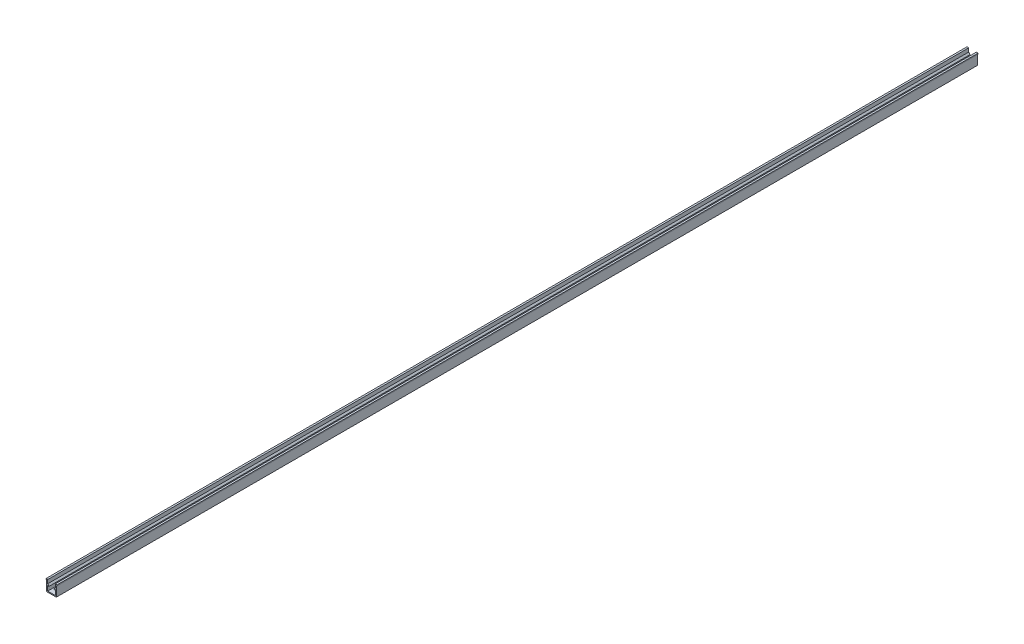
ISO-10303-21;
HEADER;
FILE_DESCRIPTION(('STEP AP214'),'2;1');
FILE_NAME('part.step','',(''),(''),'','','');
FILE_SCHEMA(('AUTOMOTIVE_DESIGN { 1 0 10303 214 1 1 1 1 }'));
ENDSEC;
DATA;
#1=APPLICATION_CONTEXT('core data for automotive mechanical design processes');
#2=APPLICATION_PROTOCOL_DEFINITION('international standard','automotive_design',2000,#1);
#3=PRODUCT_CONTEXT('',#1,'mechanical');
#4=PRODUCT('Part','Part','',(#3));
#5=PRODUCT_RELATED_PRODUCT_CATEGORY('part','',(#4));
#6=PRODUCT_DEFINITION_FORMATION('','',#4);
#7=PRODUCT_DEFINITION_CONTEXT('part definition',#1,'design');
#8=PRODUCT_DEFINITION('design','',#6,#7);
#9=PRODUCT_DEFINITION_SHAPE('','',#8);
#10=(LENGTH_UNIT() NAMED_UNIT(*) SI_UNIT(.MILLI.,.METRE.));
#11=(NAMED_UNIT(*) PLANE_ANGLE_UNIT() SI_UNIT($,.RADIAN.));
#12=(NAMED_UNIT(*) SI_UNIT($,.STERADIAN.) SOLID_ANGLE_UNIT());
#13=UNCERTAINTY_MEASURE_WITH_UNIT(LENGTH_MEASURE(1.E-05),#10,'distance_accuracy_value','');
#14=(GEOMETRIC_REPRESENTATION_CONTEXT(3) GLOBAL_UNCERTAINTY_ASSIGNED_CONTEXT((#13)) GLOBAL_UNIT_ASSIGNED_CONTEXT((#10,
#11,#12)) REPRESENTATION_CONTEXT('',''));
#15=CARTESIAN_POINT('',(0.,0.,0.));
#16=DIRECTION('',(0.,0.,1.));
#17=DIRECTION('',(1.,0.,0.));
#18=AXIS2_PLACEMENT_3D('',#15,#16,#17);
#19=CARTESIAN_POINT('',(-5.2,0.,1000.));
#20=DIRECTION('',(1.,0.,0.));
#21=DIRECTION('',(0.,0.,-1.));
#22=AXIS2_PLACEMENT_3D('',#19,#20,#21);
#23=PLANE('',#22);
#24=DIRECTION('',(0.,-1.,0.));
#25=VECTOR('',#24,1.);
#26=CARTESIAN_POINT('',(-5.2,0.,0.));
#27=LINE('',#26,#25);
#28=CARTESIAN_POINT('',(-5.2,11.,0.));
#29=VERTEX_POINT('',#28);
#30=CARTESIAN_POINT('',(-5.2,0.,0.));
#31=VERTEX_POINT('',#30);
#32=EDGE_CURVE('E203',#29,#31,#27,.T.);
#33=ORIENTED_EDGE('',*,*,#32,.T.);
#34=DIRECTION('',(0.,0.,-1.));
#35=VECTOR('',#34,1.);
#36=CARTESIAN_POINT('',(-5.2,0.,1000.));
#37=LINE('',#36,#35);
#38=CARTESIAN_POINT('',(-5.2,0.,1000.));
#39=VERTEX_POINT('',#38);
#40=EDGE_CURVE('E11',#39,#31,#37,.T.);
#41=ORIENTED_EDGE('',*,*,#40,.F.);
#42=DIRECTION('',(0.,-1.,0.));
#43=VECTOR('',#42,1.);
#44=CARTESIAN_POINT('',(-5.2,0.,1000.));
#45=LINE('',#44,#43);
#46=CARTESIAN_POINT('',(-5.2,11.,1000.));
#47=VERTEX_POINT('',#46);
#48=EDGE_CURVE('E241',#47,#39,#45,.T.);
#49=ORIENTED_EDGE('',*,*,#48,.F.);
#50=DIRECTION('',(0.,0.,-1.));
#51=VECTOR('',#50,1.);
#52=CARTESIAN_POINT('',(-5.2,11.,1000.));
#53=LINE('',#52,#51);
#54=EDGE_CURVE('E199',#47,#29,#53,.T.);
#55=ORIENTED_EDGE('',*,*,#54,.T.);
#56=EDGE_LOOP('',(#33,#41,#49,#55));
#57=FACE_BOUND('',#56,.T.);
#58=ADVANCED_FACE('F35',(#57),#23,.F.);
#59=CARTESIAN_POINT('',(5.2,0.,1000.));
#60=DIRECTION('',(0.,1.,0.));
#61=DIRECTION('',(-1.,0.,0.));
#62=AXIS2_PLACEMENT_3D('',#59,#60,#61);
#63=PLANE('',#62);
#64=DIRECTION('',(1.,0.,0.));
#65=VECTOR('',#64,1.);
#66=CARTESIAN_POINT('',(5.2,0.,0.));
#67=LINE('',#66,#65);
#68=CARTESIAN_POINT('',(5.2,0.,0.));
#69=VERTEX_POINT('',#68);
#70=EDGE_CURVE('E206',#31,#69,#67,.T.);
#71=ORIENTED_EDGE('',*,*,#70,.T.);
#72=DIRECTION('',(0.,0.,-1.));
#73=VECTOR('',#72,1.);
#74=CARTESIAN_POINT('',(5.2,0.,1000.));
#75=LINE('',#74,#73);
#76=CARTESIAN_POINT('',(5.2,0.,1000.));
#77=VERTEX_POINT('',#76);
#78=EDGE_CURVE('E43',#77,#69,#75,.T.);
#79=ORIENTED_EDGE('',*,*,#78,.F.);
#80=DIRECTION('',(1.,0.,0.));
#81=VECTOR('',#80,1.);
#82=CARTESIAN_POINT('',(5.2,0.,1000.));
#83=LINE('',#82,#81);
#84=EDGE_CURVE('E130',#39,#77,#83,.T.);
#85=ORIENTED_EDGE('',*,*,#84,.F.);
#86=ORIENTED_EDGE('',*,*,#40,.T.);
#87=EDGE_LOOP('',(#71,#79,#85,#86));
#88=FACE_BOUND('',#87,.T.);
#89=ADVANCED_FACE('F359',(#88),#63,.F.);
#90=CARTESIAN_POINT('',(5.2,0.,1000.));
#91=DIRECTION('',(-1.,0.,0.));
#92=DIRECTION('',(0.,0.,1.));
#93=AXIS2_PLACEMENT_3D('',#90,#91,#92);
#94=PLANE('',#93);
#95=DIRECTION('',(0.,1.,0.));
#96=VECTOR('',#95,1.);
#97=CARTESIAN_POINT('',(5.2,0.,0.));
#98=LINE('',#97,#96);
#99=CARTESIAN_POINT('',(5.2,11.,0.));
#100=VERTEX_POINT('',#99);
#101=EDGE_CURVE('E208',#69,#100,#98,.T.);
#102=ORIENTED_EDGE('',*,*,#101,.T.);
#103=DIRECTION('',(0.,0.,-1.));
#104=VECTOR('',#103,1.);
#105=CARTESIAN_POINT('',(5.2,11.,1000.));
#106=LINE('',#105,#104);
#107=CARTESIAN_POINT('',(5.2,11.,1000.));
#108=VERTEX_POINT('',#107);
#109=EDGE_CURVE('E284',#108,#100,#106,.T.);
#110=ORIENTED_EDGE('',*,*,#109,.F.);
#111=DIRECTION('',(0.,1.,0.));
#112=VECTOR('',#111,1.);
#113=CARTESIAN_POINT('',(5.2,0.,1000.));
#114=LINE('',#113,#112);
#115=EDGE_CURVE('E292',#77,#108,#114,.T.);
#116=ORIENTED_EDGE('',*,*,#115,.F.);
#117=ORIENTED_EDGE('',*,*,#78,.T.);
#118=EDGE_LOOP('',(#102,#110,#116,#117));
#119=FACE_BOUND('',#118,.T.);
#120=ADVANCED_FACE('F290',(#119),#94,.F.);
#121=CARTESIAN_POINT('',(5.2,11.,1000.));
#122=DIRECTION('',(0.,1.,0.));
#123=DIRECTION('',(-1.,0.,0.));
#124=AXIS2_PLACEMENT_3D('',#121,#122,#123);
#125=PLANE('',#124);
#126=DIRECTION('',(1.,0.,0.));
#127=VECTOR('',#126,1.);
#128=CARTESIAN_POINT('',(5.2,11.,0.));
#129=LINE('',#128,#127);
#130=CARTESIAN_POINT('',(6.,11.,0.));
#131=VERTEX_POINT('',#130);
#132=EDGE_CURVE('E210',#100,#131,#129,.T.);
#133=ORIENTED_EDGE('',*,*,#132,.T.);
#134=DIRECTION('',(0.,0.,-1.));
#135=VECTOR('',#134,1.);
#136=CARTESIAN_POINT('',(6.,11.,1000.));
#137=LINE('',#136,#135);
#138=CARTESIAN_POINT('',(6.,11.,1000.));
#139=VERTEX_POINT('',#138);
#140=EDGE_CURVE('E281',#139,#131,#137,.T.);
#141=ORIENTED_EDGE('',*,*,#140,.F.);
#142=DIRECTION('',(1.,0.,0.));
#143=VECTOR('',#142,1.);
#144=CARTESIAN_POINT('',(5.2,11.,1000.));
#145=LINE('',#144,#143);
#146=EDGE_CURVE('E310',#108,#139,#145,.T.);
#147=ORIENTED_EDGE('',*,*,#146,.F.);
#148=ORIENTED_EDGE('',*,*,#109,.T.);
#149=EDGE_LOOP('',(#133,#141,#147,#148));
#150=FACE_BOUND('',#149,.T.);
#151=ADVANCED_FACE('F301',(#150),#125,.F.);
#152=CARTESIAN_POINT('',(6.,11.,1000.));
#153=DIRECTION('',(-1.,0.,0.));
#154=DIRECTION('',(0.,-1.,0.));
#155=AXIS2_PLACEMENT_3D('',#152,#153,#154);
#156=PLANE('',#155);
#157=DIRECTION('',(0.,1.,0.));
#158=VECTOR('',#157,1.);
#159=CARTESIAN_POINT('',(6.,11.,0.));
#160=LINE('',#159,#158);
#161=CARTESIAN_POINT('',(6.,12.,0.));
#162=VERTEX_POINT('',#161);
#163=EDGE_CURVE('E212',#131,#162,#160,.T.);
#164=ORIENTED_EDGE('',*,*,#163,.T.);
#165=DIRECTION('',(0.,0.,-1.));
#166=VECTOR('',#165,1.);
#167=CARTESIAN_POINT('',(6.,12.,1000.));
#168=LINE('',#167,#166);
#169=CARTESIAN_POINT('',(6.,12.,1000.));
#170=VERTEX_POINT('',#169);
#171=EDGE_CURVE('E278',#170,#162,#168,.T.);
#172=ORIENTED_EDGE('',*,*,#171,.F.);
#173=DIRECTION('',(0.,1.,0.));
#174=VECTOR('',#173,1.);
#175=CARTESIAN_POINT('',(6.,11.,1000.));
#176=LINE('',#175,#174);
#177=EDGE_CURVE('E307',#139,#170,#176,.T.);
#178=ORIENTED_EDGE('',*,*,#177,.F.);
#179=ORIENTED_EDGE('',*,*,#140,.T.);
#180=EDGE_LOOP('',(#164,#172,#178,#179));
#181=FACE_BOUND('',#180,.T.);
#182=ADVANCED_FACE('F305',(#181),#156,.F.);
#183=CARTESIAN_POINT('',(6.,12.,1000.));
#184=DIRECTION('',(0.,-1.,0.));
#185=DIRECTION('',(0.,0.,-1.));
#186=AXIS2_PLACEMENT_3D('',#183,#184,#185);
#187=PLANE('',#186);
#188=DIRECTION('',(-1.,0.,0.));
#189=VECTOR('',#188,1.);
#190=CARTESIAN_POINT('',(6.,12.,0.));
#191=LINE('',#190,#189);
#192=CARTESIAN_POINT('',(4.1,12.,0.));
#193=VERTEX_POINT('',#192);
#194=EDGE_CURVE('E214',#162,#193,#191,.T.);
#195=ORIENTED_EDGE('',*,*,#194,.T.);
#196=DIRECTION('',(0.,0.,-1.));
#197=VECTOR('',#196,1.);
#198=CARTESIAN_POINT('',(4.1,12.,1000.));
#199=LINE('',#198,#197);
#200=CARTESIAN_POINT('',(4.1,12.,1000.));
#201=VERTEX_POINT('',#200);
#202=EDGE_CURVE('E275',#201,#193,#199,.T.);
#203=ORIENTED_EDGE('',*,*,#202,.F.);
#204=DIRECTION('',(-1.,0.,0.));
#205=VECTOR('',#204,1.);
#206=CARTESIAN_POINT('',(6.,12.,1000.));
#207=LINE('',#206,#205);
#208=EDGE_CURVE('E309',#170,#201,#207,.T.);
#209=ORIENTED_EDGE('',*,*,#208,.F.);
#210=ORIENTED_EDGE('',*,*,#171,.T.);
#211=EDGE_LOOP('',(#195,#203,#209,#210));
#212=FACE_BOUND('',#211,.T.);
#213=ADVANCED_FACE('F372',(#212),#187,.F.);
#214=CARTESIAN_POINT('',(4.1,12.,1000.));
#215=DIRECTION('',(1.,0.,0.));
#216=DIRECTION('',(0.,0.,-1.));
#217=AXIS2_PLACEMENT_3D('',#214,#215,#216);
#218=PLANE('',#217);
#219=DIRECTION('',(0.,-1.,0.));
#220=VECTOR('',#219,1.);
#221=CARTESIAN_POINT('',(4.1,12.,0.));
#222=LINE('',#221,#220);
#223=CARTESIAN_POINT('',(4.1,8.,0.));
#224=VERTEX_POINT('',#223);
#225=EDGE_CURVE('E216',#193,#224,#222,.T.);
#226=ORIENTED_EDGE('',*,*,#225,.T.);
#227=DIRECTION('',(0.,0.,-1.));
#228=VECTOR('',#227,1.);
#229=CARTESIAN_POINT('',(4.1,8.,1000.));
#230=LINE('',#229,#228);
#231=CARTESIAN_POINT('',(4.1,8.,1000.));
#232=VERTEX_POINT('',#231);
#233=EDGE_CURVE('E272',#232,#224,#230,.T.);
#234=ORIENTED_EDGE('',*,*,#233,.F.);
#235=DIRECTION('',(0.,-1.,0.));
#236=VECTOR('',#235,1.);
#237=CARTESIAN_POINT('',(4.1,12.,1000.));
#238=LINE('',#237,#236);
#239=EDGE_CURVE('E312',#201,#232,#238,.T.);
#240=ORIENTED_EDGE('',*,*,#239,.F.);
#241=ORIENTED_EDGE('',*,*,#202,.T.);
#242=EDGE_LOOP('',(#226,#234,#240,#241));
#243=FACE_BOUND('',#242,.T.);
#244=ADVANCED_FACE('F375',(#243),#218,.F.);
#245=CARTESIAN_POINT('',(4.1,8.,1000.));
#246=DIRECTION('',(0.707106781186546,-0.707106781186549,0.));
#247=DIRECTION('',(0.707106781186549,0.707106781186546,0.));
#248=AXIS2_PLACEMENT_3D('',#245,#246,#247);
#249=PLANE('',#248);
#250=DIRECTION('',(-0.707106781186549,-0.707106781186546,0.));
#251=VECTOR('',#250,1.);
#252=CARTESIAN_POINT('',(4.1,8.,0.));
#253=LINE('',#252,#251);
#254=CARTESIAN_POINT('',(2.54436508138959,6.4443650813896,0.));
#255=VERTEX_POINT('',#254);
#256=EDGE_CURVE('E218',#224,#255,#253,.T.);
#257=ORIENTED_EDGE('',*,*,#256,.T.);
#258=DIRECTION('',(0.,0.,-1.));
#259=VECTOR('',#258,1.);
#260=CARTESIAN_POINT('',(2.54436508138959,6.4443650813896,1000.));
#261=LINE('',#260,#259);
#262=CARTESIAN_POINT('',(2.54436508138959,6.4443650813896,1000.));
#263=VERTEX_POINT('',#262);
#264=EDGE_CURVE('E269',#263,#255,#261,.T.);
#265=ORIENTED_EDGE('',*,*,#264,.F.);
#266=DIRECTION('',(-0.707106781186549,-0.707106781186546,0.));
#267=VECTOR('',#266,1.);
#268=CARTESIAN_POINT('',(4.1,8.,1000.));
#269=LINE('',#268,#267);
#270=EDGE_CURVE('E318',#232,#263,#269,.T.);
#271=ORIENTED_EDGE('',*,*,#270,.F.);
#272=ORIENTED_EDGE('',*,*,#233,.T.);
#273=EDGE_LOOP('',(#257,#265,#271,#272));
#274=FACE_BOUND('',#273,.T.);
#275=ADVANCED_FACE('F379',(#274),#249,.F.);
#276=CARTESIAN_POINT('',(2.54436508138959,6.4443650813896,1000.));
#277=DIRECTION('',(0.707106781186549,0.707106781186546,0.));
#278=DIRECTION('',(-0.707106781186546,0.707106781186549,0.));
#279=AXIS2_PLACEMENT_3D('',#276,#277,#278);
#280=PLANE('',#279);
#281=DIRECTION('',(0.707106781186546,-0.707106781186549,0.));
#282=VECTOR('',#281,1.);
#283=CARTESIAN_POINT('',(2.54436508138959,6.4443650813896,0.));
#284=LINE('',#283,#282);
#285=CARTESIAN_POINT('',(3.25147186257614,5.73725830020305,0.));
#286=VERTEX_POINT('',#285);
#287=EDGE_CURVE('E220',#255,#286,#284,.T.);
#288=ORIENTED_EDGE('',*,*,#287,.T.);
#289=DIRECTION('',(0.,0.,-1.));
#290=VECTOR('',#289,1.);
#291=CARTESIAN_POINT('',(3.25147186257614,5.73725830020305,1000.));
#292=LINE('',#291,#290);
#293=CARTESIAN_POINT('',(3.25147186257614,5.73725830020305,1000.));
#294=VERTEX_POINT('',#293);
#295=EDGE_CURVE('E266',#294,#286,#292,.T.);
#296=ORIENTED_EDGE('',*,*,#295,.F.);
#297=DIRECTION('',(0.707106781186546,-0.707106781186549,0.));
#298=VECTOR('',#297,1.);
#299=CARTESIAN_POINT('',(2.54436508138959,6.4443650813896,1000.));
#300=LINE('',#299,#298);
#301=EDGE_CURVE('E320',#263,#294,#300,.T.);
#302=ORIENTED_EDGE('',*,*,#301,.F.);
#303=ORIENTED_EDGE('',*,*,#264,.T.);
#304=EDGE_LOOP('',(#288,#296,#302,#303));
#305=FACE_BOUND('',#304,.T.);
#306=ADVANCED_FACE('F383',(#305),#280,.F.);
#307=CARTESIAN_POINT('',(3.25147186257614,5.73725830020305,1000.));
#308=DIRECTION('',(-0.707106781186546,0.707106781186549,0.));
#309=DIRECTION('',(-0.707106781186549,-0.707106781186546,0.));
#310=AXIS2_PLACEMENT_3D('',#307,#308,#309);
#311=PLANE('',#310);
#312=DIRECTION('',(0.707106781186549,0.707106781186546,0.));
#313=VECTOR('',#312,1.);
#314=CARTESIAN_POINT('',(3.25147186257614,5.73725830020305,0.));
#315=LINE('',#314,#313);
#316=CARTESIAN_POINT('',(4.1,6.58578643762691,0.));
#317=VERTEX_POINT('',#316);
#318=EDGE_CURVE('E222',#286,#317,#315,.T.);
#319=ORIENTED_EDGE('',*,*,#318,.T.);
#320=DIRECTION('',(0.,0.,-1.));
#321=VECTOR('',#320,1.);
#322=CARTESIAN_POINT('',(4.1,6.58578643762691,1000.));
#323=LINE('',#322,#321);
#324=CARTESIAN_POINT('',(4.1,6.58578643762691,1000.));
#325=VERTEX_POINT('',#324);
#326=EDGE_CURVE('E263',#325,#317,#323,.T.);
#327=ORIENTED_EDGE('',*,*,#326,.F.);
#328=DIRECTION('',(0.707106781186549,0.707106781186546,0.));
#329=VECTOR('',#328,1.);
#330=CARTESIAN_POINT('',(3.25147186257614,5.73725830020305,1000.));
#331=LINE('',#330,#329);
#332=EDGE_CURVE('E322',#294,#325,#331,.T.);
#333=ORIENTED_EDGE('',*,*,#332,.F.);
#334=ORIENTED_EDGE('',*,*,#295,.T.);
#335=EDGE_LOOP('',(#319,#327,#333,#334));
#336=FACE_BOUND('',#335,.T.);
#337=ADVANCED_FACE('F387',(#336),#311,.F.);
#338=CARTESIAN_POINT('',(4.1,6.58578643762691,1000.));
#339=DIRECTION('',(1.,0.,0.));
#340=DIRECTION('',(0.,1.,0.));
#341=AXIS2_PLACEMENT_3D('',#338,#339,#340);
#342=PLANE('',#341);
#343=DIRECTION('',(0.,-1.,0.));
#344=VECTOR('',#343,1.);
#345=CARTESIAN_POINT('',(4.1,6.58578643762691,0.));
#346=LINE('',#345,#344);
#347=CARTESIAN_POINT('',(4.1,1.1,0.));
#348=VERTEX_POINT('',#347);
#349=EDGE_CURVE('E224',#317,#348,#346,.T.);
#350=ORIENTED_EDGE('',*,*,#349,.T.);
#351=DIRECTION('',(0.,0.,-1.));
#352=VECTOR('',#351,1.);
#353=CARTESIAN_POINT('',(4.1,1.1,1000.));
#354=LINE('',#353,#352);
#355=CARTESIAN_POINT('',(4.1,1.1,1000.));
#356=VERTEX_POINT('',#355);
#357=EDGE_CURVE('E260',#356,#348,#354,.T.);
#358=ORIENTED_EDGE('',*,*,#357,.F.);
#359=DIRECTION('',(0.,-1.,0.));
#360=VECTOR('',#359,1.);
#361=CARTESIAN_POINT('',(4.1,6.58578643762691,1000.));
#362=LINE('',#361,#360);
#363=EDGE_CURVE('E324',#325,#356,#362,.T.);
#364=ORIENTED_EDGE('',*,*,#363,.F.);
#365=ORIENTED_EDGE('',*,*,#326,.T.);
#366=EDGE_LOOP('',(#350,#358,#364,#365));
#367=FACE_BOUND('',#366,.T.);
#368=ADVANCED_FACE('F391',(#367),#342,.F.);
#369=CARTESIAN_POINT('',(-4.1,1.1,1000.));
#370=DIRECTION('',(0.,-1.,0.));
#371=DIRECTION('',(1.,0.,0.));
#372=AXIS2_PLACEMENT_3D('',#369,#370,#371);
#373=PLANE('',#372);
#374=DIRECTION('',(-1.,0.,0.));
#375=VECTOR('',#374,1.);
#376=CARTESIAN_POINT('',(-4.1,1.1,0.));
#377=LINE('',#376,#375);
#378=CARTESIAN_POINT('',(-4.1,1.1,0.));
#379=VERTEX_POINT('',#378);
#380=EDGE_CURVE('E226',#348,#379,#377,.T.);
#381=ORIENTED_EDGE('',*,*,#380,.T.);
#382=DIRECTION('',(0.,0.,-1.));
#383=VECTOR('',#382,1.);
#384=CARTESIAN_POINT('',(-4.1,1.1,1000.));
#385=LINE('',#384,#383);
#386=CARTESIAN_POINT('',(-4.1,1.1,1000.));
#387=VERTEX_POINT('',#386);
#388=EDGE_CURVE('E257',#387,#379,#385,.T.);
#389=ORIENTED_EDGE('',*,*,#388,.F.);
#390=DIRECTION('',(-1.,0.,0.));
#391=VECTOR('',#390,1.);
#392=CARTESIAN_POINT('',(-4.1,1.1,1000.));
#393=LINE('',#392,#391);
#394=EDGE_CURVE('E326',#356,#387,#393,.T.);
#395=ORIENTED_EDGE('',*,*,#394,.F.);
#396=ORIENTED_EDGE('',*,*,#357,.T.);
#397=EDGE_LOOP('',(#381,#389,#395,#396));
#398=FACE_BOUND('',#397,.T.);
#399=ADVANCED_FACE('F395',(#398),#373,.F.);
#400=CARTESIAN_POINT('',(-4.1,6.58578643762691,1000.));
#401=DIRECTION('',(-1.,0.,0.));
#402=DIRECTION('',(0.,0.,1.));
#403=AXIS2_PLACEMENT_3D('',#400,#401,#402);
#404=PLANE('',#403);
#405=DIRECTION('',(0.,1.,0.));
#406=VECTOR('',#405,1.);
#407=CARTESIAN_POINT('',(-4.1,6.58578643762691,0.));
#408=LINE('',#407,#406);
#409=CARTESIAN_POINT('',(-4.1,6.58578643762691,0.));
#410=VERTEX_POINT('',#409);
#411=EDGE_CURVE('E228',#379,#410,#408,.T.);
#412=ORIENTED_EDGE('',*,*,#411,.T.);
#413=DIRECTION('',(0.,0.,-1.));
#414=VECTOR('',#413,1.);
#415=CARTESIAN_POINT('',(-4.1,6.58578643762691,1000.));
#416=LINE('',#415,#414);
#417=CARTESIAN_POINT('',(-4.1,6.58578643762691,1000.));
#418=VERTEX_POINT('',#417);
#419=EDGE_CURVE('E254',#418,#410,#416,.T.);
#420=ORIENTED_EDGE('',*,*,#419,.F.);
#421=DIRECTION('',(0.,1.,0.));
#422=VECTOR('',#421,1.);
#423=CARTESIAN_POINT('',(-4.1,6.58578643762691,1000.));
#424=LINE('',#423,#422);
#425=EDGE_CURVE('E328',#387,#418,#424,.T.);
#426=ORIENTED_EDGE('',*,*,#425,.F.);
#427=ORIENTED_EDGE('',*,*,#388,.T.);
#428=EDGE_LOOP('',(#412,#420,#426,#427));
#429=FACE_BOUND('',#428,.T.);
#430=ADVANCED_FACE('F399',(#429),#404,.F.);
#431=CARTESIAN_POINT('',(-3.25147186257614,5.73725830020305,1000.));
#432=DIRECTION('',(0.707106781186546,0.707106781186549,0.));
#433=DIRECTION('',(-0.707106781186549,0.707106781186546,0.));
#434=AXIS2_PLACEMENT_3D('',#431,#432,#433);
#435=PLANE('',#434);
#436=DIRECTION('',(0.707106781186549,-0.707106781186546,0.));
#437=VECTOR('',#436,1.);
#438=CARTESIAN_POINT('',(-3.25147186257614,5.73725830020305,0.));
#439=LINE('',#438,#437);
#440=CARTESIAN_POINT('',(-3.25147186257614,5.73725830020305,0.));
#441=VERTEX_POINT('',#440);
#442=EDGE_CURVE('E230',#410,#441,#439,.T.);
#443=ORIENTED_EDGE('',*,*,#442,.T.);
#444=DIRECTION('',(0.,0.,-1.));
#445=VECTOR('',#444,1.);
#446=CARTESIAN_POINT('',(-3.25147186257614,5.73725830020305,1000.));
#447=LINE('',#446,#445);
#448=CARTESIAN_POINT('',(-3.25147186257614,5.73725830020305,1000.));
#449=VERTEX_POINT('',#448);
#450=EDGE_CURVE('E251',#449,#441,#447,.T.);
#451=ORIENTED_EDGE('',*,*,#450,.F.);
#452=DIRECTION('',(0.707106781186549,-0.707106781186546,0.));
#453=VECTOR('',#452,1.);
#454=CARTESIAN_POINT('',(-3.25147186257614,5.73725830020305,1000.));
#455=LINE('',#454,#453);
#456=EDGE_CURVE('E330',#418,#449,#455,.T.);
#457=ORIENTED_EDGE('',*,*,#456,.F.);
#458=ORIENTED_EDGE('',*,*,#419,.T.);
#459=EDGE_LOOP('',(#443,#451,#457,#458));
#460=FACE_BOUND('',#459,.T.);
#461=ADVANCED_FACE('F403',(#460),#435,.F.);
#462=CARTESIAN_POINT('',(-2.54436508138959,6.4443650813896,1000.));
#463=DIRECTION('',(-0.707106781186548,0.707106781186547,0.));
#464=DIRECTION('',(-0.707106781186547,-0.707106781186548,0.));
#465=AXIS2_PLACEMENT_3D('',#462,#463,#464);
#466=PLANE('',#465);
#467=DIRECTION('',(0.707106781186547,0.707106781186548,0.));
#468=VECTOR('',#467,1.);
#469=CARTESIAN_POINT('',(-2.54436508138959,6.4443650813896,0.));
#470=LINE('',#469,#468);
#471=CARTESIAN_POINT('',(-2.54436508138959,6.4443650813896,0.));
#472=VERTEX_POINT('',#471);
#473=EDGE_CURVE('E232',#441,#472,#470,.T.);
#474=ORIENTED_EDGE('',*,*,#473,.T.);
#475=DIRECTION('',(0.,0.,-1.));
#476=VECTOR('',#475,1.);
#477=CARTESIAN_POINT('',(-2.54436508138959,6.4443650813896,1000.));
#478=LINE('',#477,#476);
#479=CARTESIAN_POINT('',(-2.54436508138959,6.4443650813896,1000.));
#480=VERTEX_POINT('',#479);
#481=EDGE_CURVE('E248',#480,#472,#478,.T.);
#482=ORIENTED_EDGE('',*,*,#481,.F.);
#483=DIRECTION('',(0.707106781186547,0.707106781186548,0.));
#484=VECTOR('',#483,1.);
#485=CARTESIAN_POINT('',(-2.54436508138959,6.4443650813896,1000.));
#486=LINE('',#485,#484);
#487=EDGE_CURVE('E332',#449,#480,#486,.T.);
#488=ORIENTED_EDGE('',*,*,#487,.F.);
#489=ORIENTED_EDGE('',*,*,#450,.T.);
#490=EDGE_LOOP('',(#474,#482,#488,#489));
#491=FACE_BOUND('',#490,.T.);
#492=ADVANCED_FACE('F407',(#491),#466,.F.);
#493=CARTESIAN_POINT('',(-4.1,8.,1000.));
#494=DIRECTION('',(-0.707106781186546,-0.707106781186549,0.));
#495=DIRECTION('',(0.707106781186549,-0.707106781186546,0.));
#496=AXIS2_PLACEMENT_3D('',#493,#494,#495);
#497=PLANE('',#496);
#498=DIRECTION('',(-0.707106781186549,0.707106781186546,0.));
#499=VECTOR('',#498,1.);
#500=CARTESIAN_POINT('',(-4.1,8.,0.));
#501=LINE('',#500,#499);
#502=CARTESIAN_POINT('',(-4.1,8.,0.));
#503=VERTEX_POINT('',#502);
#504=EDGE_CURVE('E234',#472,#503,#501,.T.);
#505=ORIENTED_EDGE('',*,*,#504,.T.);
#506=DIRECTION('',(0.,0.,-1.));
#507=VECTOR('',#506,1.);
#508=CARTESIAN_POINT('',(-4.1,8.,1000.));
#509=LINE('',#508,#507);
#510=CARTESIAN_POINT('',(-4.1,8.,1000.));
#511=VERTEX_POINT('',#510);
#512=EDGE_CURVE('E245',#511,#503,#509,.T.);
#513=ORIENTED_EDGE('',*,*,#512,.F.);
#514=DIRECTION('',(-0.707106781186549,0.707106781186546,0.));
#515=VECTOR('',#514,1.);
#516=CARTESIAN_POINT('',(-4.1,8.,1000.));
#517=LINE('',#516,#515);
#518=EDGE_CURVE('E334',#480,#511,#517,.T.);
#519=ORIENTED_EDGE('',*,*,#518,.F.);
#520=ORIENTED_EDGE('',*,*,#481,.T.);
#521=EDGE_LOOP('',(#505,#513,#519,#520));
#522=FACE_BOUND('',#521,.T.);
#523=ADVANCED_FACE('F340',(#522),#497,.F.);
#524=CARTESIAN_POINT('',(-4.1,12.,1000.));
#525=DIRECTION('',(-1.,0.,0.));
#526=DIRECTION('',(0.,-1.,0.));
#527=AXIS2_PLACEMENT_3D('',#524,#525,#526);
#528=PLANE('',#527);
#529=DIRECTION('',(0.,1.,0.));
#530=VECTOR('',#529,1.);
#531=CARTESIAN_POINT('',(-4.1,12.,0.));
#532=LINE('',#531,#530);
#533=CARTESIAN_POINT('',(-4.1,12.,0.));
#534=VERTEX_POINT('',#533);
#535=EDGE_CURVE('E236',#503,#534,#532,.T.);
#536=ORIENTED_EDGE('',*,*,#535,.T.);
#537=DIRECTION('',(0.,0.,-1.));
#538=VECTOR('',#537,1.);
#539=CARTESIAN_POINT('',(-4.1,12.,1000.));
#540=LINE('',#539,#538);
#541=CARTESIAN_POINT('',(-4.1,12.,1000.));
#542=VERTEX_POINT('',#541);
#543=EDGE_CURVE('E194',#542,#534,#540,.T.);
#544=ORIENTED_EDGE('',*,*,#543,.F.);
#545=DIRECTION('',(0.,1.,0.));
#546=VECTOR('',#545,1.);
#547=CARTESIAN_POINT('',(-4.1,12.,1000.));
#548=LINE('',#547,#546);
#549=EDGE_CURVE('E185',#511,#542,#548,.T.);
#550=ORIENTED_EDGE('',*,*,#549,.F.);
#551=ORIENTED_EDGE('',*,*,#512,.T.);
#552=EDGE_LOOP('',(#536,#544,#550,#551));
#553=FACE_BOUND('',#552,.T.);
#554=ADVANCED_FACE('F344',(#553),#528,.F.);
#555=CARTESIAN_POINT('',(-6.,12.,1000.));
#556=DIRECTION('',(0.,-1.,0.));
#557=DIRECTION('',(0.,0.,-1.));
#558=AXIS2_PLACEMENT_3D('',#555,#556,#557);
#559=PLANE('',#558);
#560=DIRECTION('',(-1.,0.,0.));
#561=VECTOR('',#560,1.);
#562=CARTESIAN_POINT('',(-6.,12.,0.));
#563=LINE('',#562,#561);
#564=CARTESIAN_POINT('',(-6.,12.,0.));
#565=VERTEX_POINT('',#564);
#566=EDGE_CURVE('E193',#534,#565,#563,.T.);
#567=ORIENTED_EDGE('',*,*,#566,.T.);
#568=DIRECTION('',(0.,0.,-1.));
#569=VECTOR('',#568,1.);
#570=CARTESIAN_POINT('',(-6.,12.,1000.));
#571=LINE('',#570,#569);
#572=CARTESIAN_POINT('',(-6.,12.,1000.));
#573=VERTEX_POINT('',#572);
#574=EDGE_CURVE('E190',#573,#565,#571,.T.);
#575=ORIENTED_EDGE('',*,*,#574,.F.);
#576=DIRECTION('',(-1.,0.,0.));
#577=VECTOR('',#576,1.);
#578=CARTESIAN_POINT('',(-6.,12.,1000.));
#579=LINE('',#578,#577);
#580=EDGE_CURVE('E179',#542,#573,#579,.T.);
#581=ORIENTED_EDGE('',*,*,#580,.F.);
#582=ORIENTED_EDGE('',*,*,#543,.T.);
#583=EDGE_LOOP('',(#567,#575,#581,#582));
#584=FACE_BOUND('',#583,.T.);
#585=ADVANCED_FACE('F191',(#584),#559,.F.);
#586=CARTESIAN_POINT('',(-6.,11.,1000.));
#587=DIRECTION('',(1.,0.,0.));
#588=DIRECTION('',(0.,0.,-1.));
#589=AXIS2_PLACEMENT_3D('',#586,#587,#588);
#590=PLANE('',#589);
#591=DIRECTION('',(0.,-1.,0.));
#592=VECTOR('',#591,1.);
#593=CARTESIAN_POINT('',(-6.,11.,0.));
#594=LINE('',#593,#592);
#595=CARTESIAN_POINT('',(-6.,11.,0.));
#596=VERTEX_POINT('',#595);
#597=EDGE_CURVE('E116',#565,#596,#594,.T.);
#598=ORIENTED_EDGE('',*,*,#597,.T.);
#599=DIRECTION('',(0.,0.,-1.));
#600=VECTOR('',#599,1.);
#601=CARTESIAN_POINT('',(-6.,11.,1000.));
#602=LINE('',#601,#600);
#603=CARTESIAN_POINT('',(-6.,11.,1000.));
#604=VERTEX_POINT('',#603);
#605=EDGE_CURVE('E195',#604,#596,#602,.T.);
#606=ORIENTED_EDGE('',*,*,#605,.F.);
#607=DIRECTION('',(0.,-1.,0.));
#608=VECTOR('',#607,1.);
#609=CARTESIAN_POINT('',(-6.,11.,1000.));
#610=LINE('',#609,#608);
#611=EDGE_CURVE('E183',#573,#604,#610,.T.);
#612=ORIENTED_EDGE('',*,*,#611,.F.);
#613=ORIENTED_EDGE('',*,*,#574,.T.);
#614=EDGE_LOOP('',(#598,#606,#612,#613));
#615=FACE_BOUND('',#614,.T.);
#616=ADVANCED_FACE('F197',(#615),#590,.F.);
#617=CARTESIAN_POINT('',(-5.2,11.,1000.));
#618=DIRECTION('',(0.,1.,0.));
#619=DIRECTION('',(0.,0.,1.));
#620=AXIS2_PLACEMENT_3D('',#617,#618,#619);
#621=PLANE('',#620);
#622=DIRECTION('',(1.,0.,0.));
#623=VECTOR('',#622,1.);
#624=CARTESIAN_POINT('',(-5.2,11.,0.));
#625=LINE('',#624,#623);
#626=EDGE_CURVE('E122',#596,#29,#625,.T.);
#627=ORIENTED_EDGE('',*,*,#626,.T.);
#628=ORIENTED_EDGE('',*,*,#54,.F.);
#629=DIRECTION('',(1.,0.,0.));
#630=VECTOR('',#629,1.);
#631=CARTESIAN_POINT('',(-5.2,11.,1000.));
#632=LINE('',#631,#630);
#633=EDGE_CURVE('E51',#604,#47,#632,.T.);
#634=ORIENTED_EDGE('',*,*,#633,.F.);
#635=ORIENTED_EDGE('',*,*,#605,.T.);
#636=EDGE_LOOP('',(#627,#628,#634,#635));
#637=FACE_BOUND('',#636,.T.);
#638=ADVANCED_FACE('F348',(#637),#621,.F.);
#639=CARTESIAN_POINT('',(0.,0.,1000.));
#640=DIRECTION('',(0.,0.,1.));
#641=DIRECTION('',(1.,0.,0.));
#642=AXIS2_PLACEMENT_3D('',#639,#640,#641);
#643=PLANE('',#642);
#644=ORIENTED_EDGE('',*,*,#48,.T.);
#645=ORIENTED_EDGE('',*,*,#84,.T.);
#646=ORIENTED_EDGE('',*,*,#115,.T.);
#647=ORIENTED_EDGE('',*,*,#146,.T.);
#648=ORIENTED_EDGE('',*,*,#177,.T.);
#649=ORIENTED_EDGE('',*,*,#208,.T.);
#650=ORIENTED_EDGE('',*,*,#239,.T.);
#651=ORIENTED_EDGE('',*,*,#270,.T.);
#652=ORIENTED_EDGE('',*,*,#301,.T.);
#653=ORIENTED_EDGE('',*,*,#332,.T.);
#654=ORIENTED_EDGE('',*,*,#363,.T.);
#655=ORIENTED_EDGE('',*,*,#394,.T.);
#656=ORIENTED_EDGE('',*,*,#425,.T.);
#657=ORIENTED_EDGE('',*,*,#456,.T.);
#658=ORIENTED_EDGE('',*,*,#487,.T.);
#659=ORIENTED_EDGE('',*,*,#518,.T.);
#660=ORIENTED_EDGE('',*,*,#549,.T.);
#661=ORIENTED_EDGE('',*,*,#580,.T.);
#662=ORIENTED_EDGE('',*,*,#611,.T.);
#663=ORIENTED_EDGE('',*,*,#633,.T.);
#664=EDGE_LOOP('',(#644,#645,#646,#647,#648,#649,#650,#651,#652,#653,#654,#655,#656,#657,#658,
#659,#660,#661,#662,#663));
#665=FACE_BOUND('',#664,.T.);
#666=ADVANCED_FACE('F181',(#665),#643,.T.);
#667=CARTESIAN_POINT('',(0.,0.,0.));
#668=DIRECTION('',(0.,0.,1.));
#669=DIRECTION('',(1.,0.,0.));
#670=AXIS2_PLACEMENT_3D('',#667,#668,#669);
#671=PLANE('',#670);
#672=ORIENTED_EDGE('',*,*,#32,.F.);
#673=ORIENTED_EDGE('',*,*,#626,.F.);
#674=ORIENTED_EDGE('',*,*,#597,.F.);
#675=ORIENTED_EDGE('',*,*,#566,.F.);
#676=ORIENTED_EDGE('',*,*,#535,.F.);
#677=ORIENTED_EDGE('',*,*,#504,.F.);
#678=ORIENTED_EDGE('',*,*,#473,.F.);
#679=ORIENTED_EDGE('',*,*,#442,.F.);
#680=ORIENTED_EDGE('',*,*,#411,.F.);
#681=ORIENTED_EDGE('',*,*,#380,.F.);
#682=ORIENTED_EDGE('',*,*,#349,.F.);
#683=ORIENTED_EDGE('',*,*,#318,.F.);
#684=ORIENTED_EDGE('',*,*,#287,.F.);
#685=ORIENTED_EDGE('',*,*,#256,.F.);
#686=ORIENTED_EDGE('',*,*,#225,.F.);
#687=ORIENTED_EDGE('',*,*,#194,.F.);
#688=ORIENTED_EDGE('',*,*,#163,.F.);
#689=ORIENTED_EDGE('',*,*,#132,.F.);
#690=ORIENTED_EDGE('',*,*,#101,.F.);
#691=ORIENTED_EDGE('',*,*,#70,.F.);
#692=EDGE_LOOP('',(#672,#673,#674,#675,#676,#677,#678,#679,#680,#681,#682,#683,#684,#685,#686,
#687,#688,#689,#690,#691));
#693=FACE_BOUND('',#692,.T.);
#694=ADVANCED_FACE('F296',(#693),#671,.F.);
#695=CLOSED_SHELL('',(#58,#89,#120,#151,#182,#213,#244,#275,#306,#337,#368,#399,#430,#461,#492,
#523,#554,#585,#616,#638,#666,#694));
#696=MANIFOLD_SOLID_BREP('B2',#695);
#697=ADVANCED_BREP_SHAPE_REPRESENTATION('',(#18,#696),#14);
#698=SHAPE_DEFINITION_REPRESENTATION(#9,#697);
ENDSEC;
END-ISO-10303-21;
